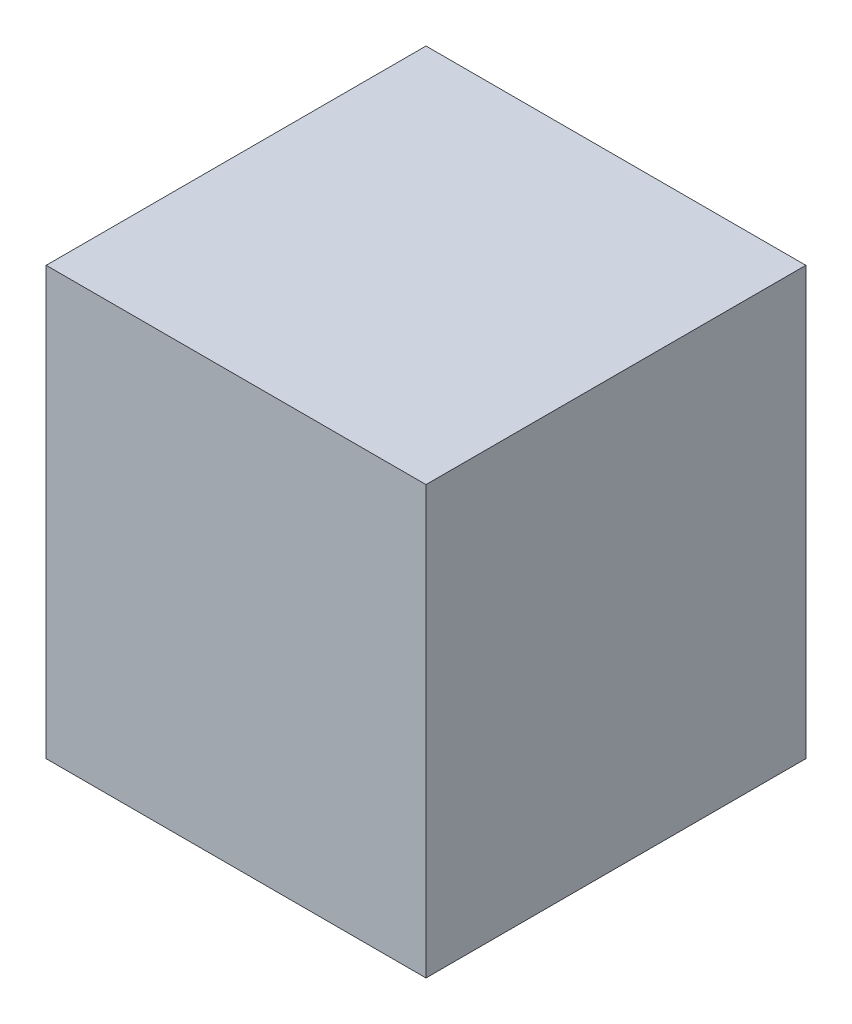
ISO-10303-21;
HEADER;
FILE_DESCRIPTION(('STEP AP214'),'2;1');
FILE_NAME('part.step','',(''),(''),'','','');
FILE_SCHEMA(('AUTOMOTIVE_DESIGN { 1 0 10303 214 1 1 1 1 }'));
ENDSEC;
DATA;
#1=APPLICATION_CONTEXT('core data for automotive mechanical design processes');
#2=APPLICATION_PROTOCOL_DEFINITION('international standard','automotive_design',2000,#1);
#3=PRODUCT_CONTEXT('',#1,'mechanical');
#4=PRODUCT('Part','Part','',(#3));
#5=PRODUCT_RELATED_PRODUCT_CATEGORY('part','',(#4));
#6=PRODUCT_DEFINITION_FORMATION('','',#4);
#7=PRODUCT_DEFINITION_CONTEXT('part definition',#1,'design');
#8=PRODUCT_DEFINITION('design','',#6,#7);
#9=PRODUCT_DEFINITION_SHAPE('','',#8);
#10=(LENGTH_UNIT() NAMED_UNIT(*) SI_UNIT(.MILLI.,.METRE.));
#11=(NAMED_UNIT(*) PLANE_ANGLE_UNIT() SI_UNIT($,.RADIAN.));
#12=(NAMED_UNIT(*) SI_UNIT($,.STERADIAN.) SOLID_ANGLE_UNIT());
#13=UNCERTAINTY_MEASURE_WITH_UNIT(LENGTH_MEASURE(1.E-05),#10,'distance_accuracy_value','');
#14=(GEOMETRIC_REPRESENTATION_CONTEXT(3) GLOBAL_UNCERTAINTY_ASSIGNED_CONTEXT((#13)) GLOBAL_UNIT_ASSIGNED_CONTEXT((#10,
#11,#12)) REPRESENTATION_CONTEXT('',''));
#15=CARTESIAN_POINT('',(0.,0.,0.));
#16=DIRECTION('',(0.,0.,1.));
#17=DIRECTION('',(1.,0.,0.));
#18=AXIS2_PLACEMENT_3D('',#15,#16,#17);
#19=CARTESIAN_POINT('',(0.,90.,0.));
#20=DIRECTION('',(-1.,0.,0.));
#21=DIRECTION('',(0.,0.,1.));
#22=AXIS2_PLACEMENT_3D('',#19,#20,#21);
#23=PLANE('',#22);
#24=DIRECTION('',(0.,0.,-1.));
#25=VECTOR('',#24,1.);
#26=CARTESIAN_POINT('',(0.,0.,0.));
#27=LINE('',#26,#25);
#28=CARTESIAN_POINT('',(0.,0.,0.));
#29=VERTEX_POINT('',#28);
#30=CARTESIAN_POINT('',(0.,0.,-80.));
#31=VERTEX_POINT('',#30);
#32=EDGE_CURVE('E76',#29,#31,#27,.T.);
#33=ORIENTED_EDGE('',*,*,#32,.T.);
#34=DIRECTION('',(0.,-1.,0.));
#35=VECTOR('',#34,1.);
#36=CARTESIAN_POINT('',(0.,90.,-80.));
#37=LINE('',#36,#35);
#38=CARTESIAN_POINT('',(0.,90.,-80.));
#39=VERTEX_POINT('',#38);
#40=EDGE_CURVE('E11',#39,#31,#37,.T.);
#41=ORIENTED_EDGE('',*,*,#40,.F.);
#42=DIRECTION('',(0.,0.,-1.));
#43=VECTOR('',#42,1.);
#44=CARTESIAN_POINT('',(0.,90.,0.));
#45=LINE('',#44,#43);
#46=CARTESIAN_POINT('',(0.,90.,0.));
#47=VERTEX_POINT('',#46);
#48=EDGE_CURVE('E94',#47,#39,#45,.T.);
#49=ORIENTED_EDGE('',*,*,#48,.F.);
#50=DIRECTION('',(0.,-1.,0.));
#51=VECTOR('',#50,1.);
#52=CARTESIAN_POINT('',(0.,90.,0.));
#53=LINE('',#52,#51);
#54=EDGE_CURVE('E88',#47,#29,#53,.T.);
#55=ORIENTED_EDGE('',*,*,#54,.T.);
#56=EDGE_LOOP('',(#33,#41,#49,#55));
#57=FACE_BOUND('',#56,.T.);
#58=ADVANCED_FACE('F32',(#57),#23,.F.);
#59=CARTESIAN_POINT('',(0.,90.,-80.));
#60=DIRECTION('',(0.,0.,1.));
#61=DIRECTION('',(1.,0.,0.));
#62=AXIS2_PLACEMENT_3D('',#59,#60,#61);
#63=PLANE('',#62);
#64=DIRECTION('',(-1.,0.,0.));
#65=VECTOR('',#64,1.);
#66=CARTESIAN_POINT('',(0.,0.,-80.));
#67=LINE('',#66,#65);
#68=CARTESIAN_POINT('',(-80.,0.,-80.));
#69=VERTEX_POINT('',#68);
#70=EDGE_CURVE('E72',#31,#69,#67,.T.);
#71=ORIENTED_EDGE('',*,*,#70,.T.);
#72=DIRECTION('',(0.,-1.,0.));
#73=VECTOR('',#72,1.);
#74=CARTESIAN_POINT('',(-80.,90.,-80.));
#75=LINE('',#74,#73);
#76=CARTESIAN_POINT('',(-80.,90.,-80.));
#77=VERTEX_POINT('',#76);
#78=EDGE_CURVE('E39',#77,#69,#75,.T.);
#79=ORIENTED_EDGE('',*,*,#78,.F.);
#80=DIRECTION('',(-1.,0.,0.));
#81=VECTOR('',#80,1.);
#82=CARTESIAN_POINT('',(0.,90.,-80.));
#83=LINE('',#82,#81);
#84=EDGE_CURVE('E84',#39,#77,#83,.T.);
#85=ORIENTED_EDGE('',*,*,#84,.F.);
#86=ORIENTED_EDGE('',*,*,#40,.T.);
#87=EDGE_LOOP('',(#71,#79,#85,#86));
#88=FACE_BOUND('',#87,.T.);
#89=ADVANCED_FACE('F83',(#88),#63,.F.);
#90=CARTESIAN_POINT('',(-80.,90.,0.));
#91=DIRECTION('',(1.,0.,0.));
#92=DIRECTION('',(0.,0.,-1.));
#93=AXIS2_PLACEMENT_3D('',#90,#91,#92);
#94=PLANE('',#93);
#95=DIRECTION('',(0.,0.,1.));
#96=VECTOR('',#95,1.);
#97=CARTESIAN_POINT('',(-80.,0.,0.));
#98=LINE('',#97,#96);
#99=CARTESIAN_POINT('',(-80.,0.,0.));
#100=VERTEX_POINT('',#99);
#101=EDGE_CURVE('E77',#69,#100,#98,.T.);
#102=ORIENTED_EDGE('',*,*,#101,.T.);
#103=DIRECTION('',(0.,-1.,0.));
#104=VECTOR('',#103,1.);
#105=CARTESIAN_POINT('',(-80.,90.,0.));
#106=LINE('',#105,#104);
#107=CARTESIAN_POINT('',(-80.,90.,0.));
#108=VERTEX_POINT('',#107);
#109=EDGE_CURVE('E100',#108,#100,#106,.T.);
#110=ORIENTED_EDGE('',*,*,#109,.F.);
#111=DIRECTION('',(0.,0.,1.));
#112=VECTOR('',#111,1.);
#113=CARTESIAN_POINT('',(-80.,90.,0.));
#114=LINE('',#113,#112);
#115=EDGE_CURVE('E51',#77,#108,#114,.T.);
#116=ORIENTED_EDGE('',*,*,#115,.F.);
#117=ORIENTED_EDGE('',*,*,#78,.T.);
#118=EDGE_LOOP('',(#102,#110,#116,#117));
#119=FACE_BOUND('',#118,.T.);
#120=ADVANCED_FACE('F103',(#119),#94,.F.);
#121=CARTESIAN_POINT('',(0.,90.,0.));
#122=DIRECTION('',(0.,0.,-1.));
#123=DIRECTION('',(-1.,0.,0.));
#124=AXIS2_PLACEMENT_3D('',#121,#122,#123);
#125=PLANE('',#124);
#126=DIRECTION('',(1.,0.,0.));
#127=VECTOR('',#126,1.);
#128=CARTESIAN_POINT('',(0.,0.,0.));
#129=LINE('',#128,#127);
#130=EDGE_CURVE('E92',#100,#29,#129,.T.);
#131=ORIENTED_EDGE('',*,*,#130,.T.);
#132=ORIENTED_EDGE('',*,*,#54,.F.);
#133=DIRECTION('',(1.,0.,0.));
#134=VECTOR('',#133,1.);
#135=CARTESIAN_POINT('',(0.,90.,0.));
#136=LINE('',#135,#134);
#137=EDGE_CURVE('E46',#108,#47,#136,.T.);
#138=ORIENTED_EDGE('',*,*,#137,.F.);
#139=ORIENTED_EDGE('',*,*,#109,.T.);
#140=EDGE_LOOP('',(#131,#132,#138,#139));
#141=FACE_BOUND('',#140,.T.);
#142=ADVANCED_FACE('F105',(#141),#125,.F.);
#143=CARTESIAN_POINT('',(0.,90.,0.));
#144=DIRECTION('',(0.,1.,0.));
#145=DIRECTION('',(0.,0.,1.));
#146=AXIS2_PLACEMENT_3D('',#143,#144,#145);
#147=PLANE('',#146);
#148=ORIENTED_EDGE('',*,*,#48,.T.);
#149=ORIENTED_EDGE('',*,*,#84,.T.);
#150=ORIENTED_EDGE('',*,*,#115,.T.);
#151=ORIENTED_EDGE('',*,*,#137,.T.);
#152=EDGE_LOOP('',(#148,#149,#150,#151));
#153=FACE_BOUND('',#152,.T.);
#154=ADVANCED_FACE('F106',(#153),#147,.T.);
#155=CARTESIAN_POINT('',(0.,0.,0.));
#156=DIRECTION('',(0.,1.,0.));
#157=DIRECTION('',(0.,0.,1.));
#158=AXIS2_PLACEMENT_3D('',#155,#156,#157);
#159=PLANE('',#158);
#160=ORIENTED_EDGE('',*,*,#32,.F.);
#161=ORIENTED_EDGE('',*,*,#130,.F.);
#162=ORIENTED_EDGE('',*,*,#101,.F.);
#163=ORIENTED_EDGE('',*,*,#70,.F.);
#164=EDGE_LOOP('',(#160,#161,#162,#163));
#165=FACE_BOUND('',#164,.T.);
#166=ADVANCED_FACE('F73',(#165),#159,.F.);
#167=CLOSED_SHELL('',(#58,#89,#120,#142,#154,#166));
#168=MANIFOLD_SOLID_BREP('B2',#167);
#169=ADVANCED_BREP_SHAPE_REPRESENTATION('',(#18,#168),#14);
#170=SHAPE_DEFINITION_REPRESENTATION(#9,#169);
ENDSEC;
END-ISO-10303-21;
